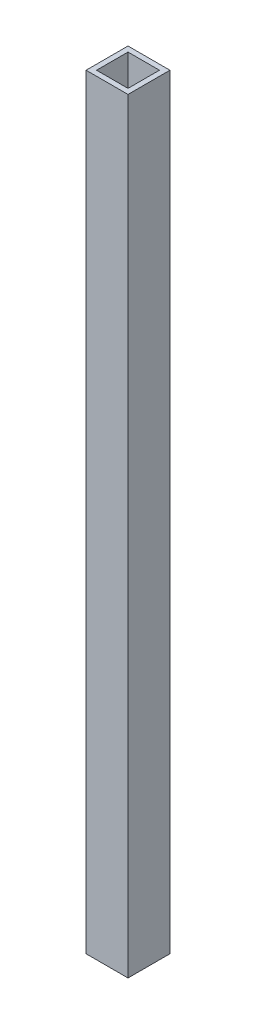
ISO-10303-21;
HEADER;
FILE_DESCRIPTION(('STEP AP214'),'2;1');
FILE_NAME('part.step','',(''),(''),'','','');
FILE_SCHEMA(('AUTOMOTIVE_DESIGN { 1 0 10303 214 1 1 1 1 }'));
ENDSEC;
DATA;
#1=APPLICATION_CONTEXT('core data for automotive mechanical design processes');
#2=APPLICATION_PROTOCOL_DEFINITION('international standard','automotive_design',2000,#1);
#3=PRODUCT_CONTEXT('',#1,'mechanical');
#4=PRODUCT('Part','Part','',(#3));
#5=PRODUCT_RELATED_PRODUCT_CATEGORY('part','',(#4));
#6=PRODUCT_DEFINITION_FORMATION('','',#4);
#7=PRODUCT_DEFINITION_CONTEXT('part definition',#1,'design');
#8=PRODUCT_DEFINITION('design','',#6,#7);
#9=PRODUCT_DEFINITION_SHAPE('','',#8);
#10=(LENGTH_UNIT() NAMED_UNIT(*) SI_UNIT(.MILLI.,.METRE.));
#11=(NAMED_UNIT(*) PLANE_ANGLE_UNIT() SI_UNIT($,.RADIAN.));
#12=(NAMED_UNIT(*) SI_UNIT($,.STERADIAN.) SOLID_ANGLE_UNIT());
#13=UNCERTAINTY_MEASURE_WITH_UNIT(LENGTH_MEASURE(1.E-05),#10,'distance_accuracy_value','');
#14=(GEOMETRIC_REPRESENTATION_CONTEXT(3) GLOBAL_UNCERTAINTY_ASSIGNED_CONTEXT((#13)) GLOBAL_UNIT_ASSIGNED_CONTEXT((#10,
#11,#12)) REPRESENTATION_CONTEXT('',''));
#15=CARTESIAN_POINT('',(0.,0.,0.));
#16=DIRECTION('',(0.,0.,1.));
#17=DIRECTION('',(1.,0.,0.));
#18=AXIS2_PLACEMENT_3D('',#15,#16,#17);
#19=CARTESIAN_POINT('',(25.4,463.55,-25.4));
#20=DIRECTION('',(0.,-1.,0.));
#21=DIRECTION('',(0.,0.,-1.));
#22=AXIS2_PLACEMENT_3D('',#19,#20,#21);
#23=PLANE('',#22);
#24=DIRECTION('',(0.,0.,-1.));
#25=VECTOR('',#24,1.);
#26=CARTESIAN_POINT('',(25.4,463.55,25.4));
#27=LINE('',#26,#25);
#28=CARTESIAN_POINT('',(25.4,463.55,25.4));
#29=VERTEX_POINT('',#28);
#30=CARTESIAN_POINT('',(25.4,463.55,-25.4));
#31=VERTEX_POINT('',#30);
#32=EDGE_CURVE('E142',#29,#31,#27,.T.);
#33=ORIENTED_EDGE('',*,*,#32,.T.);
#34=DIRECTION('',(-1.,0.,0.));
#35=VECTOR('',#34,1.);
#36=CARTESIAN_POINT('',(-25.4,463.55,-25.4));
#37=LINE('',#36,#35);
#38=CARTESIAN_POINT('',(-25.4,463.55,-25.4));
#39=VERTEX_POINT('',#38);
#40=EDGE_CURVE('E145',#31,#39,#37,.T.);
#41=ORIENTED_EDGE('',*,*,#40,.T.);
#42=DIRECTION('',(0.,0.,1.));
#43=VECTOR('',#42,1.);
#44=CARTESIAN_POINT('',(-25.4,463.55,25.4));
#45=LINE('',#44,#43);
#46=CARTESIAN_POINT('',(-25.4,463.55,25.4));
#47=VERTEX_POINT('',#46);
#48=EDGE_CURVE('E148',#39,#47,#45,.T.);
#49=ORIENTED_EDGE('',*,*,#48,.T.);
#50=DIRECTION('',(1.,0.,0.));
#51=VECTOR('',#50,1.);
#52=CARTESIAN_POINT('',(-25.4,463.55,25.4));
#53=LINE('',#52,#51);
#54=EDGE_CURVE('E150',#47,#29,#53,.T.);
#55=ORIENTED_EDGE('',*,*,#54,.T.);
#56=EDGE_LOOP('',(#33,#41,#49,#55));
#57=FACE_BOUND('',#56,.T.);
#58=DIRECTION('',(0.,0.,-1.));
#59=VECTOR('',#58,1.);
#60=CARTESIAN_POINT('',(19.05,463.55,19.05));
#61=LINE('',#60,#59);
#62=CARTESIAN_POINT('',(19.05,463.55,19.05));
#63=VERTEX_POINT('',#62);
#64=CARTESIAN_POINT('',(19.05,463.55,-19.05));
#65=VERTEX_POINT('',#64);
#66=EDGE_CURVE('E102',#63,#65,#61,.T.);
#67=ORIENTED_EDGE('',*,*,#66,.F.);
#68=DIRECTION('',(1.,0.,0.));
#69=VECTOR('',#68,1.);
#70=CARTESIAN_POINT('',(-19.05,463.55,19.05));
#71=LINE('',#70,#69);
#72=CARTESIAN_POINT('',(-19.05,463.55,19.05));
#73=VERTEX_POINT('',#72);
#74=EDGE_CURVE('E125',#73,#63,#71,.T.);
#75=ORIENTED_EDGE('',*,*,#74,.F.);
#76=DIRECTION('',(0.,0.,1.));
#77=VECTOR('',#76,1.);
#78=CARTESIAN_POINT('',(-19.05,463.55,19.05));
#79=LINE('',#78,#77);
#80=CARTESIAN_POINT('',(-19.05,463.55,-19.05));
#81=VERTEX_POINT('',#80);
#82=EDGE_CURVE('E123',#81,#73,#79,.T.);
#83=ORIENTED_EDGE('',*,*,#82,.F.);
#84=DIRECTION('',(-1.,0.,0.));
#85=VECTOR('',#84,1.);
#86=CARTESIAN_POINT('',(-19.05,463.55,-19.05));
#87=LINE('',#86,#85);
#88=EDGE_CURVE('E110',#65,#81,#87,.T.);
#89=ORIENTED_EDGE('',*,*,#88,.F.);
#90=EDGE_LOOP('',(#67,#75,#83,#89));
#91=FACE_BOUND('',#90,.T.);
#92=ADVANCED_FACE('F36',(#57,#91),#23,.F.);
#93=CARTESIAN_POINT('',(25.4,-463.55,-25.4));
#94=DIRECTION('',(0.,-1.,0.));
#95=DIRECTION('',(0.,0.,-1.));
#96=AXIS2_PLACEMENT_3D('',#93,#94,#95);
#97=PLANE('',#96);
#98=DIRECTION('',(0.,0.,-1.));
#99=VECTOR('',#98,1.);
#100=CARTESIAN_POINT('',(25.4,-463.55,25.4));
#101=LINE('',#100,#99);
#102=CARTESIAN_POINT('',(25.4,-463.55,25.4));
#103=VERTEX_POINT('',#102);
#104=CARTESIAN_POINT('',(25.4,-463.55,-25.4));
#105=VERTEX_POINT('',#104);
#106=EDGE_CURVE('E119',#103,#105,#101,.T.);
#107=ORIENTED_EDGE('',*,*,#106,.F.);
#108=DIRECTION('',(1.,0.,0.));
#109=VECTOR('',#108,1.);
#110=CARTESIAN_POINT('',(-25.4,-463.55,25.4));
#111=LINE('',#110,#109);
#112=CARTESIAN_POINT('',(-25.4,-463.55,25.4));
#113=VERTEX_POINT('',#112);
#114=EDGE_CURVE('E146',#113,#103,#111,.T.);
#115=ORIENTED_EDGE('',*,*,#114,.F.);
#116=DIRECTION('',(0.,0.,1.));
#117=VECTOR('',#116,1.);
#118=CARTESIAN_POINT('',(-25.4,-463.55,25.4));
#119=LINE('',#118,#117);
#120=CARTESIAN_POINT('',(-25.4,-463.55,-25.4));
#121=VERTEX_POINT('',#120);
#122=EDGE_CURVE('E157',#121,#113,#119,.T.);
#123=ORIENTED_EDGE('',*,*,#122,.F.);
#124=DIRECTION('',(-1.,0.,0.));
#125=VECTOR('',#124,1.);
#126=CARTESIAN_POINT('',(-25.4,-463.55,-25.4));
#127=LINE('',#126,#125);
#128=EDGE_CURVE('E155',#105,#121,#127,.T.);
#129=ORIENTED_EDGE('',*,*,#128,.F.);
#130=EDGE_LOOP('',(#107,#115,#123,#129));
#131=FACE_BOUND('',#130,.T.);
#132=DIRECTION('',(1.,0.,0.));
#133=VECTOR('',#132,1.);
#134=CARTESIAN_POINT('',(-19.05,-463.55,19.05));
#135=LINE('',#134,#133);
#136=CARTESIAN_POINT('',(-19.05,-463.55,19.05));
#137=VERTEX_POINT('',#136);
#138=CARTESIAN_POINT('',(19.05,-463.55,19.05));
#139=VERTEX_POINT('',#138);
#140=EDGE_CURVE('E111',#137,#139,#135,.T.);
#141=ORIENTED_EDGE('',*,*,#140,.T.);
#142=DIRECTION('',(0.,0.,-1.));
#143=VECTOR('',#142,1.);
#144=CARTESIAN_POINT('',(19.05,-463.55,19.05));
#145=LINE('',#144,#143);
#146=CARTESIAN_POINT('',(19.05,-463.55,-19.05));
#147=VERTEX_POINT('',#146);
#148=EDGE_CURVE('E60',#139,#147,#145,.T.);
#149=ORIENTED_EDGE('',*,*,#148,.T.);
#150=DIRECTION('',(-1.,0.,0.));
#151=VECTOR('',#150,1.);
#152=CARTESIAN_POINT('',(-19.05,-463.55,-19.05));
#153=LINE('',#152,#151);
#154=CARTESIAN_POINT('',(-19.05,-463.55,-19.05));
#155=VERTEX_POINT('',#154);
#156=EDGE_CURVE('E117',#147,#155,#153,.T.);
#157=ORIENTED_EDGE('',*,*,#156,.T.);
#158=DIRECTION('',(0.,0.,1.));
#159=VECTOR('',#158,1.);
#160=CARTESIAN_POINT('',(-19.05,-463.55,19.05));
#161=LINE('',#160,#159);
#162=EDGE_CURVE('E131',#155,#137,#161,.T.);
#163=ORIENTED_EDGE('',*,*,#162,.T.);
#164=EDGE_LOOP('',(#141,#149,#157,#163));
#165=FACE_BOUND('',#164,.T.);
#166=ADVANCED_FACE('F177',(#131,#165),#97,.T.);
#167=CARTESIAN_POINT('',(25.4,463.55,25.4));
#168=DIRECTION('',(-1.,0.,0.));
#169=DIRECTION('',(0.,0.,1.));
#170=AXIS2_PLACEMENT_3D('',#167,#168,#169);
#171=PLANE('',#170);
#172=ORIENTED_EDGE('',*,*,#106,.T.);
#173=DIRECTION('',(0.,-1.,0.));
#174=VECTOR('',#173,1.);
#175=CARTESIAN_POINT('',(25.4,463.55,-25.4));
#176=LINE('',#175,#174);
#177=EDGE_CURVE('E11',#31,#105,#176,.T.);
#178=ORIENTED_EDGE('',*,*,#177,.F.);
#179=ORIENTED_EDGE('',*,*,#32,.F.);
#180=DIRECTION('',(0.,-1.,0.));
#181=VECTOR('',#180,1.);
#182=CARTESIAN_POINT('',(25.4,463.55,25.4));
#183=LINE('',#182,#181);
#184=EDGE_CURVE('E152',#29,#103,#183,.T.);
#185=ORIENTED_EDGE('',*,*,#184,.T.);
#186=EDGE_LOOP('',(#172,#178,#179,#185));
#187=FACE_BOUND('',#186,.T.);
#188=ADVANCED_FACE('F38',(#187),#171,.F.);
#189=CARTESIAN_POINT('',(-25.4,463.55,-25.4));
#190=DIRECTION('',(0.,0.,1.));
#191=DIRECTION('',(1.,0.,0.));
#192=AXIS2_PLACEMENT_3D('',#189,#190,#191);
#193=PLANE('',#192);
#194=ORIENTED_EDGE('',*,*,#128,.T.);
#195=DIRECTION('',(0.,-1.,0.));
#196=VECTOR('',#195,1.);
#197=CARTESIAN_POINT('',(-25.4,463.55,-25.4));
#198=LINE('',#197,#196);
#199=EDGE_CURVE('E45',#39,#121,#198,.T.);
#200=ORIENTED_EDGE('',*,*,#199,.F.);
#201=ORIENTED_EDGE('',*,*,#40,.F.);
#202=ORIENTED_EDGE('',*,*,#177,.T.);
#203=EDGE_LOOP('',(#194,#200,#201,#202));
#204=FACE_BOUND('',#203,.T.);
#205=ADVANCED_FACE('F187',(#204),#193,.F.);
#206=CARTESIAN_POINT('',(-25.4,463.55,25.4));
#207=DIRECTION('',(1.,0.,0.));
#208=DIRECTION('',(0.,0.,-1.));
#209=AXIS2_PLACEMENT_3D('',#206,#207,#208);
#210=PLANE('',#209);
#211=ORIENTED_EDGE('',*,*,#122,.T.);
#212=DIRECTION('',(0.,-1.,0.));
#213=VECTOR('',#212,1.);
#214=CARTESIAN_POINT('',(-25.4,463.55,25.4));
#215=LINE('',#214,#213);
#216=EDGE_CURVE('E163',#47,#113,#215,.T.);
#217=ORIENTED_EDGE('',*,*,#216,.F.);
#218=ORIENTED_EDGE('',*,*,#48,.F.);
#219=ORIENTED_EDGE('',*,*,#199,.T.);
#220=EDGE_LOOP('',(#211,#217,#218,#219));
#221=FACE_BOUND('',#220,.T.);
#222=ADVANCED_FACE('F171',(#221),#210,.F.);
#223=CARTESIAN_POINT('',(-25.4,463.55,25.4));
#224=DIRECTION('',(0.,0.,-1.));
#225=DIRECTION('',(-1.,0.,0.));
#226=AXIS2_PLACEMENT_3D('',#223,#224,#225);
#227=PLANE('',#226);
#228=ORIENTED_EDGE('',*,*,#114,.T.);
#229=ORIENTED_EDGE('',*,*,#184,.F.);
#230=ORIENTED_EDGE('',*,*,#54,.F.);
#231=ORIENTED_EDGE('',*,*,#216,.T.);
#232=EDGE_LOOP('',(#228,#229,#230,#231));
#233=FACE_BOUND('',#232,.T.);
#234=ADVANCED_FACE('F181',(#233),#227,.F.);
#235=CARTESIAN_POINT('',(19.05,463.55,19.05));
#236=DIRECTION('',(-1.,0.,0.));
#237=DIRECTION('',(0.,0.,1.));
#238=AXIS2_PLACEMENT_3D('',#235,#236,#237);
#239=PLANE('',#238);
#240=ORIENTED_EDGE('',*,*,#148,.F.);
#241=DIRECTION('',(0.,-1.,0.));
#242=VECTOR('',#241,1.);
#243=CARTESIAN_POINT('',(19.05,463.55,19.05));
#244=LINE('',#243,#242);
#245=EDGE_CURVE('E106',#63,#139,#244,.T.);
#246=ORIENTED_EDGE('',*,*,#245,.F.);
#247=ORIENTED_EDGE('',*,*,#66,.T.);
#248=DIRECTION('',(0.,-1.,0.));
#249=VECTOR('',#248,1.);
#250=CARTESIAN_POINT('',(19.05,463.55,-19.05));
#251=LINE('',#250,#249);
#252=EDGE_CURVE('E105',#65,#147,#251,.T.);
#253=ORIENTED_EDGE('',*,*,#252,.T.);
#254=EDGE_LOOP('',(#240,#246,#247,#253));
#255=FACE_BOUND('',#254,.T.);
#256=ADVANCED_FACE('F104',(#255),#239,.T.);
#257=CARTESIAN_POINT('',(-19.05,463.55,-19.05));
#258=DIRECTION('',(0.,0.,1.));
#259=DIRECTION('',(1.,0.,0.));
#260=AXIS2_PLACEMENT_3D('',#257,#258,#259);
#261=PLANE('',#260);
#262=ORIENTED_EDGE('',*,*,#156,.F.);
#263=ORIENTED_EDGE('',*,*,#252,.F.);
#264=ORIENTED_EDGE('',*,*,#88,.T.);
#265=DIRECTION('',(0.,-1.,0.));
#266=VECTOR('',#265,1.);
#267=CARTESIAN_POINT('',(-19.05,463.55,-19.05));
#268=LINE('',#267,#266);
#269=EDGE_CURVE('E120',#81,#155,#268,.T.);
#270=ORIENTED_EDGE('',*,*,#269,.T.);
#271=EDGE_LOOP('',(#262,#263,#264,#270));
#272=FACE_BOUND('',#271,.T.);
#273=ADVANCED_FACE('F114',(#272),#261,.T.);
#274=CARTESIAN_POINT('',(-19.05,463.55,19.05));
#275=DIRECTION('',(1.,0.,0.));
#276=DIRECTION('',(0.,0.,-1.));
#277=AXIS2_PLACEMENT_3D('',#274,#275,#276);
#278=PLANE('',#277);
#279=ORIENTED_EDGE('',*,*,#162,.F.);
#280=ORIENTED_EDGE('',*,*,#269,.F.);
#281=ORIENTED_EDGE('',*,*,#82,.T.);
#282=DIRECTION('',(0.,-1.,0.));
#283=VECTOR('',#282,1.);
#284=CARTESIAN_POINT('',(-19.05,463.55,19.05));
#285=LINE('',#284,#283);
#286=EDGE_CURVE('E52',#73,#137,#285,.T.);
#287=ORIENTED_EDGE('',*,*,#286,.T.);
#288=EDGE_LOOP('',(#279,#280,#281,#287));
#289=FACE_BOUND('',#288,.T.);
#290=ADVANCED_FACE('F210',(#289),#278,.T.);
#291=CARTESIAN_POINT('',(-19.05,463.55,19.05));
#292=DIRECTION('',(0.,0.,-1.));
#293=DIRECTION('',(-1.,0.,0.));
#294=AXIS2_PLACEMENT_3D('',#291,#292,#293);
#295=PLANE('',#294);
#296=ORIENTED_EDGE('',*,*,#140,.F.);
#297=ORIENTED_EDGE('',*,*,#286,.F.);
#298=ORIENTED_EDGE('',*,*,#74,.T.);
#299=ORIENTED_EDGE('',*,*,#245,.T.);
#300=EDGE_LOOP('',(#296,#297,#298,#299));
#301=FACE_BOUND('',#300,.T.);
#302=ADVANCED_FACE('F214',(#301),#295,.T.);
#303=CLOSED_SHELL('',(#92,#166,#188,#205,#222,#234,#256,#273,#290,#302));
#304=MANIFOLD_SOLID_BREP('B2',#303);
#305=ADVANCED_BREP_SHAPE_REPRESENTATION('',(#18,#304),#14);
#306=SHAPE_DEFINITION_REPRESENTATION(#9,#305);
ENDSEC;
END-ISO-10303-21;
